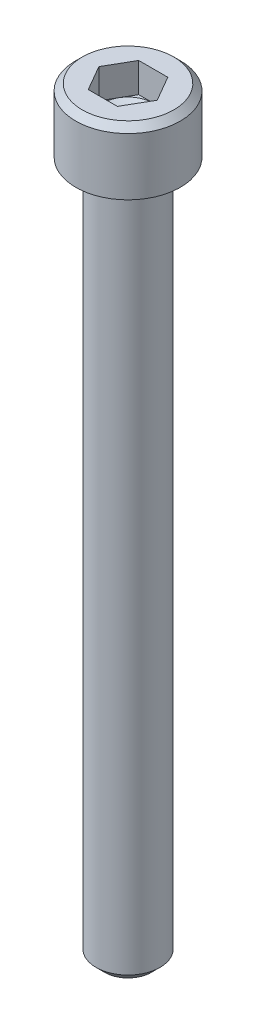
ISO-10303-21;
HEADER;
FILE_DESCRIPTION(('STEP AP214'),'2;1');
FILE_NAME('part.step','',(''),(''),'','','');
FILE_SCHEMA(('AUTOMOTIVE_DESIGN { 1 0 10303 214 1 1 1 1 }'));
ENDSEC;
DATA;
#1=APPLICATION_CONTEXT('core data for automotive mechanical design processes');
#2=APPLICATION_PROTOCOL_DEFINITION('international standard','automotive_design',2000,#1);
#3=PRODUCT_CONTEXT('',#1,'mechanical');
#4=PRODUCT('Part','Part','',(#3));
#5=PRODUCT_RELATED_PRODUCT_CATEGORY('part','',(#4));
#6=PRODUCT_DEFINITION_FORMATION('','',#4);
#7=PRODUCT_DEFINITION_CONTEXT('part definition',#1,'design');
#8=PRODUCT_DEFINITION('design','',#6,#7);
#9=PRODUCT_DEFINITION_SHAPE('','',#8);
#10=(LENGTH_UNIT() NAMED_UNIT(*) SI_UNIT(.MILLI.,.METRE.));
#11=(NAMED_UNIT(*) PLANE_ANGLE_UNIT() SI_UNIT($,.RADIAN.));
#12=(NAMED_UNIT(*) SI_UNIT($,.STERADIAN.) SOLID_ANGLE_UNIT());
#13=UNCERTAINTY_MEASURE_WITH_UNIT(LENGTH_MEASURE(1.E-05),#10,'distance_accuracy_value','');
#14=(GEOMETRIC_REPRESENTATION_CONTEXT(3) GLOBAL_UNCERTAINTY_ASSIGNED_CONTEXT((#13)) GLOBAL_UNIT_ASSIGNED_CONTEXT((#10,
#11,#12)) REPRESENTATION_CONTEXT('',''));
#15=CARTESIAN_POINT('',(0.,0.,0.));
#16=DIRECTION('',(0.,0.,1.));
#17=DIRECTION('',(1.,0.,0.));
#18=AXIS2_PLACEMENT_3D('',#15,#16,#17);
#19=CARTESIAN_POINT('',(0.,1.87960000005205,0.));
#20=DIRECTION('',(0.,1.,0.));
#21=DIRECTION('',(0.,0.,1.));
#22=AXIS2_PLACEMENT_3D('',#19,#20,#21);
#23=CONICAL_SURFACE('',#22,1.38430000009748,1.04719755120119);
#24=CARTESIAN_POINT('',(0.,1.08037402233663,5.6843418860808E-11));
#25=VERTEX_POINT('',#24);
#26=VERTEX_LOOP('',#25);
#27=FACE_BOUND('',#26,.T.);
#28=CARTESIAN_POINT('',(0.,1.87959999992078,0.));
#29=DIRECTION('',(0.,1.,0.));
#30=DIRECTION('',(0.,0.,1.));
#31=AXIS2_PLACEMENT_3D('',#28,#29,#30);
#32=CIRCLE('',#31,1.38429999987011);
#33=CARTESIAN_POINT('',(0.,1.87959999996039,-1.38429999993505));
#34=VERTEX_POINT('',#33);
#35=CARTESIAN_POINT('',(1.1988389664588,1.87959999996039,-0.692149999999999));
#36=VERTEX_POINT('',#35);
#37=EDGE_CURVE('E120',#34,#36,#32,.F.);
#38=ORIENTED_EDGE('',*,*,#37,.F.);
#39=CARTESIAN_POINT('',(0.,1.87959999998641,0.));
#40=DIRECTION('',(0.,1.,0.));
#41=DIRECTION('',(0.,0.,1.));
#42=AXIS2_PLACEMENT_3D('',#39,#40,#41);
#43=CIRCLE('',#42,1.3842999999838);
#44=CARTESIAN_POINT('',(-1.19883896645178,1.87959999999321,-0.692149999995952));
#45=VERTEX_POINT('',#44);
#46=EDGE_CURVE('E158',#45,#34,#43,.F.);
#47=ORIENTED_EDGE('',*,*,#46,.F.);
#48=CARTESIAN_POINT('',(0.,1.87959999998641,0.));
#49=DIRECTION('',(0.,1.,0.));
#50=DIRECTION('',(0.,0.,1.));
#51=AXIS2_PLACEMENT_3D('',#48,#49,#50);
#52=CIRCLE('',#51,1.3842999999838);
#53=CARTESIAN_POINT('',(-1.19883896645178,1.87960000001923,0.692149999995948));
#54=VERTEX_POINT('',#53);
#55=EDGE_CURVE('E155',#54,#45,#52,.F.);
#56=ORIENTED_EDGE('',*,*,#55,.F.);
#57=CARTESIAN_POINT('',(0.,1.87960000005205,0.));
#58=DIRECTION('',(0.,1.,0.));
#59=DIRECTION('',(0.,0.,1.));
#60=AXIS2_PLACEMENT_3D('',#57,#58,#59);
#61=CIRCLE('',#60,1.38430000009748);
#62=CARTESIAN_POINT('',(0.,1.87960000001923,1.38430000004064));
#63=VERTEX_POINT('',#62);
#64=EDGE_CURVE('E99',#63,#54,#61,.F.);
#65=ORIENTED_EDGE('',*,*,#64,.F.);
#66=CARTESIAN_POINT('',(0.,1.87959999998641,0.));
#67=DIRECTION('',(0.,1.,0.));
#68=DIRECTION('',(0.,0.,1.));
#69=AXIS2_PLACEMENT_3D('',#66,#67,#68);
#70=CIRCLE('',#69,1.3842999999838);
#71=CARTESIAN_POINT('',(1.19883896645178,1.87959999999321,0.692149999995949));
#72=VERTEX_POINT('',#71);
#73=EDGE_CURVE('E93',#72,#63,#70,.F.);
#74=ORIENTED_EDGE('',*,*,#73,.F.);
#75=CARTESIAN_POINT('',(0.,1.87959999998641,0.));
#76=DIRECTION('',(0.,1.,0.));
#77=DIRECTION('',(0.,0.,1.));
#78=AXIS2_PLACEMENT_3D('',#75,#76,#77);
#79=CIRCLE('',#78,1.3842999999838);
#80=EDGE_CURVE('E96',#36,#72,#79,.F.);
#81=ORIENTED_EDGE('',*,*,#80,.F.);
#82=EDGE_LOOP('',(#38,#47,#56,#65,#74,#81));
#83=FACE_BOUND('',#82,.T.);
#84=ADVANCED_FACE('F15',(#27,#83),#23,.F.);
#85=CARTESIAN_POINT('',(0.,1.8796,0.));
#86=DIRECTION('',(0.,1.,0.));
#87=DIRECTION('',(0.,0.,1.));
#88=AXIS2_PLACEMENT_3D('',#85,#86,#87);
#89=PLANE('',#88);
#90=DIRECTION('',(0.500000000000001,0.,-0.866025403784438));
#91=VECTOR('',#90,1.);
#92=CARTESIAN_POINT('',(0.799225977639198,1.8796,1.3843));
#93=LINE('',#92,#91);
#94=CARTESIAN_POINT('',(0.799225977639198,1.8796,1.3843));
#95=VERTEX_POINT('',#94);
#96=EDGE_CURVE('E105',#95,#72,#93,.T.);
#97=ORIENTED_EDGE('',*,*,#96,.T.);
#98=ORIENTED_EDGE('',*,*,#73,.T.);
#99=DIRECTION('',(1.,0.,0.));
#100=VECTOR('',#99,1.);
#101=CARTESIAN_POINT('',(-0.799225977639198,1.8796,1.3843));
#102=LINE('',#101,#100);
#103=EDGE_CURVE('E107',#63,#95,#102,.T.);
#104=ORIENTED_EDGE('',*,*,#103,.T.);
#105=EDGE_LOOP('',(#97,#98,#104));
#106=FACE_BOUND('',#105,.T.);
#107=ADVANCED_FACE('F106',(#106),#89,.T.);
#108=CARTESIAN_POINT('',(0.,1.8796,0.));
#109=DIRECTION('',(0.,1.,0.));
#110=DIRECTION('',(0.,0.,1.));
#111=AXIS2_PLACEMENT_3D('',#108,#109,#110);
#112=PLANE('',#111);
#113=DIRECTION('',(-0.499999999999999,0.,-0.866025403784439));
#114=VECTOR('',#113,1.);
#115=CARTESIAN_POINT('',(1.5984519552784,1.8796,0.));
#116=LINE('',#115,#114);
#117=CARTESIAN_POINT('',(1.5984519552784,1.8796,0.));
#118=VERTEX_POINT('',#117);
#119=EDGE_CURVE('E118',#118,#36,#116,.T.);
#120=ORIENTED_EDGE('',*,*,#119,.T.);
#121=ORIENTED_EDGE('',*,*,#80,.T.);
#122=DIRECTION('',(0.500000000000001,0.,-0.866025403784438));
#123=VECTOR('',#122,1.);
#124=CARTESIAN_POINT('',(0.799225977639198,1.8796,1.3843));
#125=LINE('',#124,#123);
#126=EDGE_CURVE('E112',#72,#118,#125,.T.);
#127=ORIENTED_EDGE('',*,*,#126,.T.);
#128=EDGE_LOOP('',(#120,#121,#127));
#129=FACE_BOUND('',#128,.T.);
#130=ADVANCED_FACE('F115',(#129),#112,.T.);
#131=CARTESIAN_POINT('',(0.,1.8796,0.));
#132=DIRECTION('',(0.,1.,0.));
#133=DIRECTION('',(0.,0.,1.));
#134=AXIS2_PLACEMENT_3D('',#131,#132,#133);
#135=PLANE('',#134);
#136=DIRECTION('',(-1.,0.,0.));
#137=VECTOR('',#136,1.);
#138=CARTESIAN_POINT('',(0.799225977639201,1.8796,-1.3843));
#139=LINE('',#138,#137);
#140=CARTESIAN_POINT('',(0.799225977639201,1.8796,-1.3843));
#141=VERTEX_POINT('',#140);
#142=EDGE_CURVE('E168',#141,#34,#139,.T.);
#143=ORIENTED_EDGE('',*,*,#142,.T.);
#144=ORIENTED_EDGE('',*,*,#37,.T.);
#145=DIRECTION('',(-0.499999999999999,0.,-0.866025403784439));
#146=VECTOR('',#145,1.);
#147=CARTESIAN_POINT('',(1.5984519552784,1.8796,0.));
#148=LINE('',#147,#146);
#149=EDGE_CURVE('E165',#36,#141,#148,.T.);
#150=ORIENTED_EDGE('',*,*,#149,.T.);
#151=EDGE_LOOP('',(#143,#144,#150));
#152=FACE_BOUND('',#151,.T.);
#153=ADVANCED_FACE('F164',(#152),#135,.T.);
#154=CARTESIAN_POINT('',(0.,1.8796,0.));
#155=DIRECTION('',(0.,1.,0.));
#156=DIRECTION('',(0.,0.,1.));
#157=AXIS2_PLACEMENT_3D('',#154,#155,#156);
#158=PLANE('',#157);
#159=DIRECTION('',(-0.5,0.,0.866025403784438));
#160=VECTOR('',#159,1.);
#161=CARTESIAN_POINT('',(-0.799225977639195,1.8796,-1.3843));
#162=LINE('',#161,#160);
#163=CARTESIAN_POINT('',(-0.799225977639196,1.8796,-1.3843));
#164=VERTEX_POINT('',#163);
#165=EDGE_CURVE('E183',#164,#45,#162,.T.);
#166=ORIENTED_EDGE('',*,*,#165,.T.);
#167=ORIENTED_EDGE('',*,*,#46,.T.);
#168=DIRECTION('',(-1.,0.,0.));
#169=VECTOR('',#168,1.);
#170=CARTESIAN_POINT('',(0.799225977639201,1.8796,-1.3843));
#171=LINE('',#170,#169);
#172=EDGE_CURVE('E184',#34,#164,#171,.T.);
#173=ORIENTED_EDGE('',*,*,#172,.T.);
#174=EDGE_LOOP('',(#166,#167,#173));
#175=FACE_BOUND('',#174,.T.);
#176=ADVANCED_FACE('F328',(#175),#158,.T.);
#177=CARTESIAN_POINT('',(0.,1.8796,0.));
#178=DIRECTION('',(0.,1.,0.));
#179=DIRECTION('',(0.,0.,1.));
#180=AXIS2_PLACEMENT_3D('',#177,#178,#179);
#181=PLANE('',#180);
#182=DIRECTION('',(0.5,0.,0.866025403784439));
#183=VECTOR('',#182,1.);
#184=CARTESIAN_POINT('',(-1.5984519552784,1.8796,0.));
#185=LINE('',#184,#183);
#186=CARTESIAN_POINT('',(-1.5984519552784,1.8796,0.));
#187=VERTEX_POINT('',#186);
#188=EDGE_CURVE('E196',#187,#54,#185,.T.);
#189=ORIENTED_EDGE('',*,*,#188,.T.);
#190=ORIENTED_EDGE('',*,*,#55,.T.);
#191=DIRECTION('',(-0.5,0.,0.866025403784438));
#192=VECTOR('',#191,1.);
#193=CARTESIAN_POINT('',(-0.799225977639195,1.8796,-1.3843));
#194=LINE('',#193,#192);
#195=EDGE_CURVE('E197',#45,#187,#194,.T.);
#196=ORIENTED_EDGE('',*,*,#195,.T.);
#197=EDGE_LOOP('',(#189,#190,#196));
#198=FACE_BOUND('',#197,.T.);
#199=ADVANCED_FACE('F324',(#198),#181,.T.);
#200=CARTESIAN_POINT('',(0.,1.8796,0.));
#201=DIRECTION('',(0.,1.,0.));
#202=DIRECTION('',(0.,0.,1.));
#203=AXIS2_PLACEMENT_3D('',#200,#201,#202);
#204=PLANE('',#203);
#205=DIRECTION('',(1.,0.,0.));
#206=VECTOR('',#205,1.);
#207=CARTESIAN_POINT('',(-0.799225977639198,1.8796,1.3843));
#208=LINE('',#207,#206);
#209=CARTESIAN_POINT('',(-0.799225977639198,1.8796,1.3843));
#210=VERTEX_POINT('',#209);
#211=EDGE_CURVE('E139',#210,#63,#208,.T.);
#212=ORIENTED_EDGE('',*,*,#211,.T.);
#213=ORIENTED_EDGE('',*,*,#64,.T.);
#214=DIRECTION('',(0.5,0.,0.866025403784439));
#215=VECTOR('',#214,1.);
#216=CARTESIAN_POINT('',(-1.5984519552784,1.8796,0.));
#217=LINE('',#216,#215);
#218=EDGE_CURVE('E215',#54,#210,#217,.T.);
#219=ORIENTED_EDGE('',*,*,#218,.T.);
#220=EDGE_LOOP('',(#212,#213,#219));
#221=FACE_BOUND('',#220,.T.);
#222=ADVANCED_FACE('F320',(#221),#204,.T.);
#223=CARTESIAN_POINT('',(-0.799225977639198,3.5052,1.3843));
#224=DIRECTION('',(0.,0.,1.));
#225=DIRECTION('',(1.,0.,0.));
#226=AXIS2_PLACEMENT_3D('',#223,#224,#225);
#227=PLANE('',#226);
#228=DIRECTION('',(1.,0.,0.));
#229=VECTOR('',#228,1.);
#230=CARTESIAN_POINT('',(0.,3.5052,1.3843));
#231=LINE('',#230,#229);
#232=CARTESIAN_POINT('',(-0.799225977639198,3.5052,1.3843));
#233=VERTEX_POINT('',#232);
#234=CARTESIAN_POINT('',(0.799225977639198,3.5052,1.3843));
#235=VERTEX_POINT('',#234);
#236=EDGE_CURVE('E210',#233,#235,#231,.T.);
#237=ORIENTED_EDGE('',*,*,#236,.T.);
#238=DIRECTION('',(0.,1.,0.));
#239=VECTOR('',#238,1.);
#240=CARTESIAN_POINT('',(0.799225977639198,3.5052,1.3843));
#241=LINE('',#240,#239);
#242=EDGE_CURVE('E125',#235,#95,#241,.F.);
#243=ORIENTED_EDGE('',*,*,#242,.T.);
#244=ORIENTED_EDGE('',*,*,#103,.F.);
#245=ORIENTED_EDGE('',*,*,#211,.F.);
#246=DIRECTION('',(0.,1.,0.));
#247=VECTOR('',#246,1.);
#248=CARTESIAN_POINT('',(-0.799225977639198,3.5052,1.3843));
#249=LINE('',#248,#247);
#250=EDGE_CURVE('E211',#210,#233,#249,.T.);
#251=ORIENTED_EDGE('',*,*,#250,.T.);
#252=EDGE_LOOP('',(#237,#243,#244,#245,#251));
#253=FACE_BOUND('',#252,.T.);
#254=ADVANCED_FACE('F317',(#253),#227,.F.);
#255=CARTESIAN_POINT('',(0.799225977639198,3.5052,1.3843));
#256=DIRECTION('',(0.866025403784438,0.,0.500000000000001));
#257=DIRECTION('',(0.500000000000001,0.,-0.866025403784438));
#258=AXIS2_PLACEMENT_3D('',#255,#256,#257);
#259=PLANE('',#258);
#260=DIRECTION('',(0.500000000000001,0.,-0.866025403784438));
#261=VECTOR('',#260,1.);
#262=CARTESIAN_POINT('',(0.799225977639198,3.5052,1.3843));
#263=LINE('',#262,#261);
#264=CARTESIAN_POINT('',(1.5984519552784,3.5052,0.));
#265=VERTEX_POINT('',#264);
#266=EDGE_CURVE('E227',#235,#265,#263,.T.);
#267=ORIENTED_EDGE('',*,*,#266,.T.);
#268=DIRECTION('',(0.,1.,0.));
#269=VECTOR('',#268,1.);
#270=CARTESIAN_POINT('',(1.5984519552784,3.5052,0.));
#271=LINE('',#270,#269);
#272=EDGE_CURVE('E124',#265,#118,#271,.F.);
#273=ORIENTED_EDGE('',*,*,#272,.T.);
#274=ORIENTED_EDGE('',*,*,#126,.F.);
#275=ORIENTED_EDGE('',*,*,#96,.F.);
#276=ORIENTED_EDGE('',*,*,#242,.F.);
#277=EDGE_LOOP('',(#267,#273,#274,#275,#276));
#278=FACE_BOUND('',#277,.T.);
#279=ADVANCED_FACE('F122',(#278),#259,.F.);
#280=CARTESIAN_POINT('',(1.5984519552784,3.5052,0.));
#281=DIRECTION('',(0.866025403784439,0.,-0.499999999999999));
#282=DIRECTION('',(-0.499999999999999,0.,-0.866025403784439));
#283=AXIS2_PLACEMENT_3D('',#280,#281,#282);
#284=PLANE('',#283);
#285=DIRECTION('',(-0.499999999999999,0.,-0.866025403784439));
#286=VECTOR('',#285,1.);
#287=CARTESIAN_POINT('',(1.5984519552784,3.5052,0.));
#288=LINE('',#287,#286);
#289=CARTESIAN_POINT('',(0.799225977639201,3.5052,-1.3843));
#290=VERTEX_POINT('',#289);
#291=EDGE_CURVE('E229',#265,#290,#288,.T.);
#292=ORIENTED_EDGE('',*,*,#291,.T.);
#293=DIRECTION('',(0.,1.,0.));
#294=VECTOR('',#293,1.);
#295=CARTESIAN_POINT('',(0.799225977639201,3.5052,-1.3843));
#296=LINE('',#295,#294);
#297=EDGE_CURVE('E172',#290,#141,#296,.F.);
#298=ORIENTED_EDGE('',*,*,#297,.T.);
#299=ORIENTED_EDGE('',*,*,#149,.F.);
#300=ORIENTED_EDGE('',*,*,#119,.F.);
#301=ORIENTED_EDGE('',*,*,#272,.F.);
#302=EDGE_LOOP('',(#292,#298,#299,#300,#301));
#303=FACE_BOUND('',#302,.T.);
#304=ADVANCED_FACE('F170',(#303),#284,.F.);
#305=CARTESIAN_POINT('',(0.799225977639201,3.5052,-1.3843));
#306=DIRECTION('',(0.,0.,-1.));
#307=DIRECTION('',(-1.,0.,0.));
#308=AXIS2_PLACEMENT_3D('',#305,#306,#307);
#309=PLANE('',#308);
#310=DIRECTION('',(1.,0.,0.));
#311=VECTOR('',#310,1.);
#312=CARTESIAN_POINT('',(0.,3.5052,-1.3843));
#313=LINE('',#312,#311);
#314=CARTESIAN_POINT('',(-0.799225977639196,3.5052,-1.3843));
#315=VERTEX_POINT('',#314);
#316=EDGE_CURVE('E231',#290,#315,#313,.F.);
#317=ORIENTED_EDGE('',*,*,#316,.T.);
#318=DIRECTION('',(0.,1.,0.));
#319=VECTOR('',#318,1.);
#320=CARTESIAN_POINT('',(-0.799225977639195,3.5052,-1.3843));
#321=LINE('',#320,#319);
#322=EDGE_CURVE('E193',#315,#164,#321,.F.);
#323=ORIENTED_EDGE('',*,*,#322,.T.);
#324=ORIENTED_EDGE('',*,*,#172,.F.);
#325=ORIENTED_EDGE('',*,*,#142,.F.);
#326=ORIENTED_EDGE('',*,*,#297,.F.);
#327=EDGE_LOOP('',(#317,#323,#324,#325,#326));
#328=FACE_BOUND('',#327,.T.);
#329=ADVANCED_FACE('F308',(#328),#309,.F.);
#330=CARTESIAN_POINT('',(-0.799225977639195,3.5052,-1.3843));
#331=DIRECTION('',(-0.866025403784438,0.,-0.5));
#332=DIRECTION('',(-0.5,0.,0.866025403784438));
#333=AXIS2_PLACEMENT_3D('',#330,#331,#332);
#334=PLANE('',#333);
#335=DIRECTION('',(-0.500000000000002,0.,0.866025403784438));
#336=VECTOR('',#335,1.);
#337=CARTESIAN_POINT('',(-0.799225977639195,3.5052,-1.3843));
#338=LINE('',#337,#336);
#339=CARTESIAN_POINT('',(-1.5984519552784,3.5052,0.));
#340=VERTEX_POINT('',#339);
#341=EDGE_CURVE('E233',#315,#340,#338,.T.);
#342=ORIENTED_EDGE('',*,*,#341,.T.);
#343=DIRECTION('',(0.,1.,0.));
#344=VECTOR('',#343,1.);
#345=CARTESIAN_POINT('',(-1.5984519552784,3.5052,0.));
#346=LINE('',#345,#344);
#347=EDGE_CURVE('E207',#340,#187,#346,.F.);
#348=ORIENTED_EDGE('',*,*,#347,.T.);
#349=ORIENTED_EDGE('',*,*,#195,.F.);
#350=ORIENTED_EDGE('',*,*,#165,.F.);
#351=ORIENTED_EDGE('',*,*,#322,.F.);
#352=EDGE_LOOP('',(#342,#348,#349,#350,#351));
#353=FACE_BOUND('',#352,.T.);
#354=ADVANCED_FACE('F304',(#353),#334,.F.);
#355=CARTESIAN_POINT('',(-1.5984519552784,3.5052,0.));
#356=DIRECTION('',(-0.866025403784439,0.,0.5));
#357=DIRECTION('',(0.5,0.,0.866025403784439));
#358=AXIS2_PLACEMENT_3D('',#355,#356,#357);
#359=PLANE('',#358);
#360=DIRECTION('',(0.5,0.,0.866025403784439));
#361=VECTOR('',#360,1.);
#362=CARTESIAN_POINT('',(-1.5984519552784,3.5052,0.));
#363=LINE('',#362,#361);
#364=EDGE_CURVE('E153',#340,#233,#363,.T.);
#365=ORIENTED_EDGE('',*,*,#364,.T.);
#366=ORIENTED_EDGE('',*,*,#250,.F.);
#367=ORIENTED_EDGE('',*,*,#218,.F.);
#368=ORIENTED_EDGE('',*,*,#188,.F.);
#369=ORIENTED_EDGE('',*,*,#347,.F.);
#370=EDGE_LOOP('',(#365,#366,#367,#368,#369));
#371=FACE_BOUND('',#370,.T.);
#372=ADVANCED_FACE('F300',(#371),#359,.F.);
#373=CARTESIAN_POINT('',(0.,3.5052,0.));
#374=DIRECTION('',(0.,-1.,0.));
#375=DIRECTION('',(0.,0.,-1.));
#376=AXIS2_PLACEMENT_3D('',#373,#374,#375);
#377=PLANE('',#376);
#378=ORIENTED_EDGE('',*,*,#341,.F.);
#379=ORIENTED_EDGE('',*,*,#316,.F.);
#380=ORIENTED_EDGE('',*,*,#291,.F.);
#381=ORIENTED_EDGE('',*,*,#266,.F.);
#382=ORIENTED_EDGE('',*,*,#236,.F.);
#383=ORIENTED_EDGE('',*,*,#364,.F.);
#384=EDGE_LOOP('',(#378,#379,#380,#381,#382,#383));
#385=FACE_BOUND('',#384,.T.);
#386=CARTESIAN_POINT('',(0.,3.50520000102961,0.));
#387=DIRECTION('',(0.,-1.,0.));
#388=DIRECTION('',(1.,0.,0.));
#389=AXIS2_PLACEMENT_3D('',#386,#387,#388);
#390=CIRCLE('',#389,2.51459999901726);
#391=CARTESIAN_POINT('',(2.51459999901726,3.50520000102961,0.));
#392=VERTEX_POINT('',#391);
#393=EDGE_CURVE('E150',#392,#392,#390,.T.);
#394=ORIENTED_EDGE('',*,*,#393,.F.);
#395=EDGE_LOOP('',(#394));
#396=FACE_BOUND('',#395,.T.);
#397=ADVANCED_FACE('F296',(#385,#396),#377,.F.);
#398=CARTESIAN_POINT('',(0.,3.14960000184783,0.));
#399=DIRECTION('',(0.,-1.,0.));
#400=DIRECTION('',(1.,0.,0.));
#401=AXIS2_PLACEMENT_3D('',#398,#399,#400);
#402=CONICAL_SURFACE('',#401,2.8701999981422,0.785398163317522);
#403=CARTESIAN_POINT('',(0.,3.1496,0.));
#404=DIRECTION('',(0.,-1.,0.));
#405=DIRECTION('',(0.,0.,-1.));
#406=AXIS2_PLACEMENT_3D('',#403,#404,#405);
#407=CIRCLE('',#406,2.8702);
#408=CARTESIAN_POINT('',(0.,3.1496,-2.8702));
#409=VERTEX_POINT('',#408);
#410=EDGE_CURVE('E149',#409,#409,#407,.T.);
#411=ORIENTED_EDGE('',*,*,#410,.F.);
#412=EDGE_LOOP('',(#411));
#413=FACE_BOUND('',#412,.T.);
#414=ORIENTED_EDGE('',*,*,#393,.T.);
#415=EDGE_LOOP('',(#414));
#416=FACE_BOUND('',#415,.T.);
#417=ADVANCED_FACE('F292',(#413,#416),#402,.T.);
#418=CARTESIAN_POINT('',(0.,5.58546,0.));
#419=DIRECTION('',(0.,-1.,0.));
#420=DIRECTION('',(0.,0.,-1.));
#421=AXIS2_PLACEMENT_3D('',#418,#419,#420);
#422=CYLINDRICAL_SURFACE('',#421,2.8702);
#423=CARTESIAN_POINT('',(0.,0.,0.));
#424=DIRECTION('',(0.,-1.,0.));
#425=DIRECTION('',(0.,0.,-1.));
#426=AXIS2_PLACEMENT_3D('',#423,#424,#425);
#427=CIRCLE('',#426,2.8702);
#428=CARTESIAN_POINT('',(0.,0.,-2.8702));
#429=VERTEX_POINT('',#428);
#430=EDGE_CURVE('E146',#429,#429,#427,.T.);
#431=ORIENTED_EDGE('',*,*,#430,.F.);
#432=EDGE_LOOP('',(#431));
#433=FACE_BOUND('',#432,.T.);
#434=ORIENTED_EDGE('',*,*,#410,.T.);
#435=EDGE_LOOP('',(#434));
#436=FACE_BOUND('',#435,.T.);
#437=ADVANCED_FACE('F288',(#433,#436),#422,.T.);
#438=CARTESIAN_POINT('',(0.,-38.1,0.));
#439=DIRECTION('',(0.,-1.,0.));
#440=DIRECTION('',(0.,0.,-1.));
#441=AXIS2_PLACEMENT_3D('',#438,#439,#440);
#442=PLANE('',#441);
#443=CARTESIAN_POINT('',(0.,-38.100000001009,0.));
#444=DIRECTION('',(0.,1.,0.));
#445=DIRECTION('',(0.,0.,1.));
#446=AXIS2_PLACEMENT_3D('',#443,#444,#445);
#447=CIRCLE('',#446,1.2801599989416);
#448=CARTESIAN_POINT('',(0.,-38.100000001009,1.2801599989416));
#449=VERTEX_POINT('',#448);
#450=EDGE_CURVE('E142',#449,#449,#447,.T.);
#451=ORIENTED_EDGE('',*,*,#450,.F.);
#452=EDGE_LOOP('',(#451));
#453=FACE_BOUND('',#452,.T.);
#454=ADVANCED_FACE('F277',(#453),#442,.T.);
#455=CARTESIAN_POINT('',(0.,0.,0.));
#456=DIRECTION('',(0.,-1.,0.));
#457=DIRECTION('',(0.,0.,-1.));
#458=AXIS2_PLACEMENT_3D('',#455,#456,#457);
#459=PLANE('',#458);
#460=CARTESIAN_POINT('',(-2.0066,0.,0.));
#461=CARTESIAN_POINT('',(-2.00659107125037,-2.17372417731573E-10,-0.00466417912295062));
#462=CARTESIAN_POINT('',(-2.00656818150294,-5.08689040938276E-10,-0.00932835809195502));
#463=CARTESIAN_POINT('',(-2.00646194575931,-1.4436833953423E-09,-0.0224980446793489));
#464=CARTESIAN_POINT('',(-2.0063443334026,-2.17995457543655E-09,-0.0310032934790011));
#465=CARTESIAN_POINT('',(-2.00592436920175,-3.80214652783731E-09,-0.0518524949147936));
#466=CARTESIAN_POINT('',(-2.00556257246323,-4.60547425629851E-09,-0.0641952914634144));
#467=CARTESIAN_POINT('',(-2.00446549349536,-6.27154855269247E-09,-0.092710935031785));
#468=CARTESIAN_POINT('',(-2.00364903422839,-7.07502708096622E-09,-0.108880695035327));
#469=CARTESIAN_POINT('',(-2.00138611323741,-8.57357001299133E-09,-0.14502987593377));
#470=CARTESIAN_POINT('',(-1.99983613298495,-9.19767329246378E-09,-0.165002871846353));
#471=CARTESIAN_POINT('',(-1.99578557902614,-1.02497240668701E-08,-0.208718776686783));
#472=CARTESIAN_POINT('',(-1.99315971287711,-1.06171043842025E-08,-0.232450133426172));
#473=CARTESIAN_POINT('',(-1.98657325334525,-1.10888584521111E-08,-0.283614389250321));
#474=CARTESIAN_POINT('',(-1.98246588177666,-1.11414025321392E-08,-0.311028480883419));
#475=CARTESIAN_POINT('',(-1.97247230497577,-1.09639964244428E-08,-0.369449365350258));
#476=CARTESIAN_POINT('',(-1.96641845944816,-1.06938848349515E-08,-0.400427505535502));
#477=CARTESIAN_POINT('',(-1.95203115968284,-9.89426990824788E-09,-0.465817665255936));
#478=CARTESIAN_POINT('',(-1.94350992555125,-9.33719573978899E-09,-0.500188700943714));
#479=CARTESIAN_POINT('',(-1.92899162757292,-8.37273550181542E-09,-0.552756345468155));
#480=CARTESIAN_POINT('',(-1.92363258523647,-8.01409993985775E-09,-0.571131762823284));
#481=CARTESIAN_POINT('',(-1.91210887662568,-7.26966673569718E-09,-0.608640426007387));
#482=CARTESIAN_POINT('',(-1.9059172786478,-6.88340914758666E-09,-0.627765430841449));
#483=CARTESIAN_POINT('',(-1.8926531178931,-6.03900676906752E-09,-0.666730005736731));
#484=CARTESIAN_POINT('',(-1.88555259715065,-5.57830895306115E-09,-0.686560055005602));
#485=CARTESIAN_POINT('',(-1.87039210837565,-4.84629397936236E-09,-0.726885562160989));
#486=CARTESIAN_POINT('',(-1.86230315323351,-4.58457116845413E-09,-0.747370125746264));
#487=CARTESIAN_POINT('',(-1.84474413619814,-3.27483388922217E-09,-0.789789835591336));
#488=CARTESIAN_POINT('',(-1.83521512406348,-2.1619913999618E-09,-0.811700597128929));
#489=CARTESIAN_POINT('',(-1.81538947694117,-2.44289198071639E-10,-0.855171751419322));
#490=CARTESIAN_POINT('',(-1.80509284735109,5.60572679911494E-10,-0.876732146634461));
#491=CARTESIAN_POINT('',(-1.78374308810927,-2.22615197483665E-09,-0.919475260597962));
#492=CARTESIAN_POINT('',(-1.77268995419049,-5.8177633075741E-09,-0.940657977215199));
#493=CARTESIAN_POINT('',(-1.74984266803556,-2.68140368498055E-08,-0.982620386013393));
#494=CARTESIAN_POINT('',(-1.73804850223372,-4.42189520000659E-08,-1.00340007080714));
#495=CARTESIAN_POINT('',(-1.71372822644424,-9.30065573260291E-08,-1.04452785357651));
#496=CARTESIAN_POINT('',(-1.70120209379136,-1.24389680534056E-07,-1.06487593816109));
#497=CARTESIAN_POINT('',(-1.68189071005398,-2.1706586973768E-07,-1.09506338268652));
#498=CARTESIAN_POINT('',(-1.67536631309325,-2.55560335864502E-07,-1.10507042929671));
#499=CARTESIAN_POINT('',(-1.66551597391481,-2.92454713630481E-07,-1.11985795817529));
#500=CARTESIAN_POINT('',(-1.66226478689897,-3.01292324988849E-07,-1.12468822374474));
#501=CARTESIAN_POINT('',(-1.64789832863821,-3.22726996693511E-07,-1.14581372489602));
#502=CARTESIAN_POINT('',(-1.636541968214,-2.93913248166431E-07,-1.16194507058645));
#503=CARTESIAN_POINT('',(-1.60155110269778,-2.03523157943073E-07,-1.2101087748921));
#504=CARTESIAN_POINT('',(-1.57718421705209,-1.3844986365244E-07,-1.24161434230092));
#505=CARTESIAN_POINT('',(-1.53585304662112,-5.99763167432239E-08,-1.29187971241513));
#506=CARTESIAN_POINT('',(-1.5194347452822,-3.63841312156832E-08,-1.31109275642661));
#507=CARTESIAN_POINT('',(-1.48592851212118,-7.02378354748848E-09,-1.34884174848752));
#508=CARTESIAN_POINT('',(-1.46884236731981,-1.21096556081093E-09,-1.36737927717382));
#509=CARTESIAN_POINT('',(-1.44069878884883,4.28184349258728E-10,-1.39679865368243));
#510=CARTESIAN_POINT('',(-1.42985084841684,-7.63875555731625E-10,-1.4078821137349));
#511=CARTESIAN_POINT('',(-1.40197239658634,-2.42473650937832E-09,-1.43573521171882));
#512=CARTESIAN_POINT('',(-1.38477276164506,-2.15312162000432E-09,-1.45233640300063));
#513=CARTESIAN_POINT('',(-1.34979601921316,-8.97682662995708E-10,-1.48491758027379));
#514=CARTESIAN_POINT('',(-1.3320189238899,8.61264076592923E-11,-1.50089757933839));
#515=CARTESIAN_POINT('',(-1.29591287909011,-1.44720178847023E-10,-1.53222137771586));
#516=CARTESIAN_POINT('',(-1.27758393212768,-1.35936582188619E-09,-1.54756517992635));
#517=CARTESIAN_POINT('',(-1.24039671100612,-1.6979805779475E-08,-1.57759775232392));
#518=CARTESIAN_POINT('',(-1.22153843052638,-3.13857576722766E-08,-1.59228651468395));
#519=CARTESIAN_POINT('',(-1.18331193082143,-7.624315410548E-08,-1.62098647090216));
#520=CARTESIAN_POINT('',(-1.16394369710635,-1.06695055045551E-07,-1.63499764547513));
#521=CARTESIAN_POINT('',(-1.13453797522568,-2.03842876251541E-07,-1.65550687214814));
#522=CARTESIAN_POINT('',(-1.12467681878487,-2.44806163489079E-07,-1.66225892096569));
#523=CARTESIAN_POINT('',(-1.10989529467611,-2.86529269660004E-07,-1.67216698897289));
#524=CARTESIAN_POINT('',(-1.10502493633019,-2.97136751831384E-07,-1.67539760791403));
#525=CARTESIAN_POINT('',(-1.08364289719895,-3.25408009909288E-07,-1.6894328929251));
#526=CARTESIAN_POINT('',(-1.06697030770968,-2.99939732945329E-07,-1.69999282000085));
#527=CARTESIAN_POINT('',(-1.02417312953762,-2.31742604165867E-07,-1.72621628700712));
#528=CARTESIAN_POINT('',(-0.997835689675166,-1.871549882317E-07,-1.74153479290111));
#529=CARTESIAN_POINT('',(-0.963027566640394,-1.31302509755612E-07,-1.76072296713663));
#530=CARTESIAN_POINT('',(-0.954860461856639,-1.18414246139726E-07,-1.76515070690561));
#531=CARTESIAN_POINT('',(-0.92340397757229,-7.28836948513213E-08,-1.7819230737943));
#532=CARTESIAN_POINT('',(-0.899898978307661,-4.74521641235008E-08,-1.79386732331947));
#533=CARTESIAN_POINT('',(-0.853333703129807,-1.36873716377939E-08,-1.81638903815323));
#534=CARTESIAN_POINT('',(-0.830290114483393,-4.74512600808109E-09,-1.82700107108451));
#535=CARTESIAN_POINT('',(-0.794060750572248,8.2392068628733E-11,-1.8428690029017));
#536=CARTESIAN_POINT('',(-0.781005352004837,-1.52204158506432E-11,-1.84842459737041));
#537=CARTESIAN_POINT('',(-0.745808147504192,-4.03169523795394E-10,-1.86297914626568));
#538=CARTESIAN_POINT('',(-0.723563822759986,-7.7969143327115E-10,-1.87173199117378));
#539=CARTESIAN_POINT('',(-0.678779669737502,-5.13978327351335E-10,-1.8884430019663));
#540=CARTESIAN_POINT('',(-0.6562398485848,1.28232167059106E-10,-1.89640118697336));
#541=CARTESIAN_POINT('',(-0.610894117492838,-3.16438390033108E-10,-1.91151907770501));
#542=CARTESIAN_POINT('',(-0.588088209369373,-1.40330764902007E-09,-1.91867878887493));
#543=CARTESIAN_POINT('',(-0.542238263813657,-1.58064614105453E-08,-1.93219093924182));
#544=CARTESIAN_POINT('',(-0.51919422390049,-2.91228734507229E-08,-1.93854337001915));
#545=CARTESIAN_POINT('',(-0.472894487820451,-7.1007504254823E-08,-1.95042749547901));
#546=CARTESIAN_POINT('',(-0.449638785813452,-9.95761451160483E-08,-1.95595916744206));
#547=CARTESIAN_POINT('',(-0.41462312605267,-1.93428062095696E-07,-1.96365312389372));
#548=CARTESIAN_POINT('',(-0.402928807919902,-2.33214157375791E-07,-1.96611726020354));
#549=CARTESIAN_POINT('',(-0.385566953614097,-2.73203637890335E-07,-1.96959667614286));
#550=CARTESIAN_POINT('',(-0.379917254896827,-2.83234803870748E-07,-1.97070094217815));
#551=CARTESIAN_POINT('',(-0.354936385380374,-3.10356489097724E-07,-1.97546071547243));
#552=CARTESIAN_POINT('',(-0.335550434222069,-2.85882898956264E-07,-1.97882985053516));
#553=CARTESIAN_POINT('',(-0.285940030213482,-2.20737483580227E-07,-1.98669684722702));
#554=CARTESIAN_POINT('',(-0.255649911325044,-1.78591896133503E-07,-1.99078867419358));
#555=CARTESIAN_POINT('',(-0.216004382919225,-1.25570615676064E-07,-1.99521616496931));
#556=CARTESIAN_POINT('',(-0.206716322215919,-1.1330176885027E-07,-1.99618717632358));
#557=CARTESIAN_POINT('',(-0.171573768567341,-7.06265717566099E-08,-1.99961340903278));
#558=CARTESIAN_POINT('',(-0.145674926833488,-4.68322396916685E-08,-2.00163210575391));
#559=CARTESIAN_POINT('',(-0.0944902196310278,-1.46598759354592E-08,-2.00462571553725));
#560=CARTESIAN_POINT('',(-0.0692058376111983,-5.89878980874125E-09,-2.00562629080244));
#561=CARTESIAN_POINT('',(-0.0292772017960967,-3.78213810592856E-10,-2.00645995855446));
#562=CARTESIAN_POINT('',(-0.0146387534995744,-1.17197388306547E-10,-2.00660733621226));
#563=CARTESIAN_POINT('',(0.023892474335974,1.91282442321442E-10,-2.00658802628992));
#564=CARTESIAN_POINT('',(0.0477857679469371,-5.50829993931221E-13,-2.00616391430296));
#565=CARTESIAN_POINT('',(0.095541426724868,-5.99569503994549E-11,-2.00446803364737));
#566=CARTESIAN_POINT('',(0.119403792473587,7.24640110749992E-11,-2.00319628116162));
#567=CARTESIAN_POINT('',(0.167068858979938,-2.20299590405446E-09,-1.99981272385316));
#568=CARTESIAN_POINT('',(0.190871559940359,-4.61086813491821E-09,-1.99770092188953));
#569=CARTESIAN_POINT('',(0.238388021459979,-2.15714959517381E-08,-1.99263986255505));
#570=CARTESIAN_POINT('',(0.262101780923085,-3.6124400719299E-08,-1.98969059489762));
#571=CARTESIAN_POINT('',(0.30941068189519,-7.89166188985837E-08,-1.98295234457647));
#572=CARTESIAN_POINT('',(0.333005820068019,-1.07156315093394E-07,-1.9791633384291));
#573=CARTESIAN_POINT('',(0.368289455882111,-1.97210663342158E-07,-1.97287118068365));
#574=CARTESIAN_POINT('',(0.380032896476445,-2.35180067174636E-07,-1.97067226613574));
#575=CARTESIAN_POINT('',(0.397339161000045,-2.71649476808518E-07,-1.96725428557992));
#576=CARTESIAN_POINT('',(0.402919663242346,-2.80406132293027E-07,-1.9661247907913));
#577=CARTESIAN_POINT('',(0.427720297518202,-3.03054260824843E-07,-1.96098433242395));
#578=CARTESIAN_POINT('',(0.446881627742742,-2.77022300213355E-07,-1.95668948406659));
#579=CARTESIAN_POINT('',(0.504878275768167,-1.94766405212411E-07,-1.94278505253125));
#580=CARTESIAN_POINT('',(0.543504340404772,-1.35234091357691E-07,-1.93228365275804));
#581=CARTESIAN_POINT('',(0.605937797584589,-6.19245922871136E-08,-1.91328135979532));
#582=CARTESIAN_POINT('',(0.629958682531899,-3.93703856749126E-08,-1.90547015807005));
#583=CARTESIAN_POINT('',(0.677629186807667,-1.01358280444866E-08,-1.88897161416029));
#584=CARTESIAN_POINT('',(0.701279611917189,-3.41417359700502E-09,-1.88028661344407));
#585=CARTESIAN_POINT('',(0.739202768090774,2.58529787677104E-10,-1.86555630154349));
#586=CARTESIAN_POINT('',(0.753581506210322,-2.56690877276177E-11,-1.85978150375803));
#587=CARTESIAN_POINT('',(0.789964706495839,-3.66408093049474E-10,-1.84469394422711));
#588=CARTESIAN_POINT('',(0.81187813170943,-2.16054726869098E-10,-1.8351601102195));
#589=CARTESIAN_POINT('',(0.855351990580033,3.99842675979718E-11,-1.81532076316739));
#590=CARTESIAN_POINT('',(0.876912430015962,1.45670627856011E-10,-1.80501526277167));
#591=CARTESIAN_POINT('',(0.919656570425399,-2.68664088133534E-09,-1.78365049043271));
#592=CARTESIAN_POINT('',(0.940840271918547,-5.62463455227699E-09,-1.77259121952926));
#593=CARTESIAN_POINT('',(0.982804839082464,-2.43595396045539E-08,-1.74973254162744));
#594=CARTESIAN_POINT('',(1.00358569925935,-4.01566262299392E-08,-1.73793312454437));
#595=CARTESIAN_POINT('',(1.04471630865199,-8.58575277259819E-08,-1.71360351955151));
#596=CARTESIAN_POINT('',(1.0650660455061,-1.15761746521153E-07,-1.70107331072623));
#597=CARTESIAN_POINT('',(1.09525663897101,-2.08428146173775E-07,-1.68175692892747));
#598=CARTESIAN_POINT('',(1.10526484492458,-2.47287481751222E-07,-1.67523105340291));
#599=CARTESIAN_POINT('',(1.12002480504975,-2.84981693725614E-07,-1.66539770224488));
#600=CARTESIAN_POINT('',(1.12482661056459,-2.94122688753924E-07,-1.66216537529849));
#601=CARTESIAN_POINT('',(1.14590069109473,-3.17090359100481E-07,-1.64783323046937));
#602=CARTESIAN_POINT('',(1.16200915339673,-2.89393685127294E-07,-1.63649245242608));
#603=CARTESIAN_POINT('',(1.21018413460286,-2.02005047779883E-07,-1.60149350559882));
#604=CARTESIAN_POINT('',(1.24172200484787,-1.3856113362472E-07,-1.57710038905457));
#605=CARTESIAN_POINT('',(1.29227604777616,-6.08318743074535E-08,-1.53552664897674));
#606=CARTESIAN_POINT('',(1.31173894543603,-3.7081231704641E-08,-1.51888417773068));
#607=CARTESIAN_POINT('',(1.34975120010269,-7.44932679865014E-09,-1.48510514774278));
#608=CARTESIAN_POINT('',(1.36830950112601,-1.32398098087814E-09,-1.46797868832498));
#609=CARTESIAN_POINT('',(1.39743729514071,4.19855084395713E-10,-1.44007620040027));
#610=CARTESIAN_POINT('',(1.40821656386841,-7.25664792177732E-10,-1.42951781682778));
#611=CARTESIAN_POINT('',(1.43577872448199,-2.51334991505337E-09,-1.40192620658365));
#612=CARTESIAN_POINT('',(1.45238643207876,-2.46948242500763E-09,-1.3847170883089));
#613=CARTESIAN_POINT('',(1.48498041130782,-1.29727229877586E-09,-1.34972137951828));
#614=CARTESIAN_POINT('',(1.50096669789629,-1.68955779632914E-10,-1.33193480291943));
#615=CARTESIAN_POINT('',(1.5323028344961,1.67745987866142E-10,-1.29580972199658));
#616=CARTESIAN_POINT('',(1.54765268875282,-6.23855954684702E-10,-1.27747122135565));
#617=CARTESIAN_POINT('',(1.57769715384677,-1.56534483425098E-08,-1.24026482635673));
#618=CARTESIAN_POINT('',(1.59239175764599,-2.98915831797512E-08,-1.22139692631605));
#619=CARTESIAN_POINT('',(1.62110320299027,-7.55204399699909E-08,-1.18315109753476));
#620=CARTESIAN_POINT('',(1.63512002544705,-1.06911644696731E-07,-1.1637731544536));
#621=CARTESIAN_POINT('',(1.65563757958855,-2.07769769687607E-07,-1.13435281134885));
#622=CARTESIAN_POINT('',(1.66239238132601,-2.50353491935446E-07,-1.12448676982347));
#623=CARTESIAN_POINT('',(1.67238287328491,-2.95113275016874E-07,-1.10958103857176));
#624=CARTESIAN_POINT('',(1.6756920347586,-3.06848970307235E-07,-1.10459060850639));
#625=CARTESIAN_POINT('',(1.68985231159034,-3.37773871307583E-07,-1.08300478262753));
#626=CARTESIAN_POINT('',(1.70045652298473,-3.11492652666891E-07,-1.06624731607185));
#627=CARTESIAN_POINT('',(1.73143065202333,-2.25226604566411E-07,-1.01563656850264));
#628=CARTESIAN_POINT('',(1.75104970384524,-1.57675467831531E-07,-0.981319277925646));
#629=CARTESIAN_POINT('',(1.78281457088173,-6.92050738981926E-08,-0.921721784874699));
#630=CARTESIAN_POINT('',(1.79547530136543,-4.04391554524291E-08,-0.896713472760415));
#631=CARTESIAN_POINT('',(1.81870714341438,-6.48682831314561E-09,-0.848341758862092));
#632=CARTESIAN_POINT('',(1.82936438275546,5.00563599901634E-10,-0.825019862254951));
#633=CARTESIAN_POINT('',(1.84444333617104,-2.447728841809E-10,-0.790285340640318));
#634=CARTESIAN_POINT('',(1.8492117983066,-2.19108719952222E-09,-0.779021774200387));
#635=CARTESIAN_POINT('',(1.86297473527329,-7.3944688850988E-09,-0.745698849088275));
#636=CARTESIAN_POINT('',(1.87169178287484,-1.01458339275579E-08,-0.72352385649768));
#637=CARTESIAN_POINT('',(1.88833192992913,-1.42093993731505E-08,-0.678878849408444));
#638=CARTESIAN_POINT('',(1.89625504142139,-1.55216216029341E-08,-0.656408839389394));
#639=CARTESIAN_POINT('',(1.91130573146428,-1.49827209513654E-08,-0.611203960805103));
#640=CARTESIAN_POINT('',(1.91843331229332,-1.31316071301103E-08,-0.588469092998627));
#641=CARTESIAN_POINT('',(1.93188104520408,-7.81602025108158E-09,-0.542761506198228));
#642=CARTESIAN_POINT('',(1.93820118966421,-4.35153196569716E-09,-0.519788784961359));
#643=CARTESIAN_POINT('',(1.94969993928075,-1.64007665649498E-10,-0.474925414629888));
#644=CARTESIAN_POINT('',(1.95492259989927,7.0140997538732E-10,-0.453046038041715));
#645=CARTESIAN_POINT('',(1.96520701393094,-3.6819666850589E-09,-0.40649331678065));
#646=CARTESIAN_POINT('',(1.97017464302623,-9.67517962947938E-09,-0.381799080916671));
#647=CARTESIAN_POINT('',(1.97892023553242,-1.61264361234305E-08,-0.333550386011262));
#648=CARTESIAN_POINT('',(1.98274726038093,-1.68607370757958E-08,-0.310004803061296));
#649=CARTESIAN_POINT('',(1.98954430099479,-1.39892513926078E-08,-0.262790995233034));
#650=CARTESIAN_POINT('',(1.99251433759502,-1.0383570280649E-08,-0.239122773350548));
#651=CARTESIAN_POINT('',(1.99759974422885,-4.03068901678489E-10,-0.191695189179325));
#652=CARTESIAN_POINT('',(1.9997151532352,5.97162506525501E-09,-0.167935831096474));
#653=CARTESIAN_POINT('',(2.00287464134365,-8.07468907206425E-09,-0.123017541605981));
#654=CARTESIAN_POINT('',(2.00401209095241,-2.55780545986379E-08,-0.101865023481262));
#655=CARTESIAN_POINT('',(2.00589622797837,-4.83515844738133E-08,-0.0538125130355811));
#656=CARTESIAN_POINT('',(2.00645412406588,-4.90349043582115E-08,-0.026904786864114));
#657=CARTESIAN_POINT('',(2.0066,0.,0.));
#658=B_SPLINE_CURVE_WITH_KNOTS('',3,(#460,#461,#462,#463,#464,#465,#466,#467,#468,#469,#470,
#471,#472,#473,#474,#475,#476,#477,#478,#479,#480,#481,#482,#483,#484,#485,#486,#487,#488,#489,
#490,#491,#492,#493,#494,#495,#496,#497,#498,#499,#500,#501,#502,#503,#504,#505,#506,#507,#508,
#509,#510,#511,#512,#513,#514,#515,#516,#517,#518,#519,#520,#521,#522,#523,#524,#525,#526,#527,
#528,#529,#530,#531,#532,#533,#534,#535,#536,#537,#538,#539,#540,#541,#542,#543,#544,#545,#546,
#547,#548,#549,#550,#551,#552,#553,#554,#555,#556,#557,#558,#559,#560,#561,#562,#563,#564,#565,
#566,#567,#568,#569,#570,#571,#572,#573,#574,#575,#576,#577,#578,#579,#580,#581,#582,#583,#584,
#585,#586,#587,#588,#589,#590,#591,#592,#593,#594,#595,#596,#597,#598,#599,#600,#601,#602,#603,
#604,#605,#606,#607,#608,#609,#610,#611,#612,#613,#614,#615,#616,#617,#618,#619,#620,#621,#622,
#623,#624,#625,#626,#627,#628,#629,#630,#631,#632,#633,#634,#635,#636,#637,#638,#639,#640,#641,
#642,#643,#644,#645,#646,#647,#648,#649,#650,#651,#652,#653,#654,#655,#656,#657),.UNSPECIFIED.,
.F.,.F.,(4,2,2,2,2,2,2,2,2,2,2,2,2,2,2,2,2,2,2,2,2,2,2,2,2,2,2,2,2,2,2,2,2,2,2,2,2,2,2,2,2,2,2,
2,2,2,2,2,2,2,2,2,2,2,2,2,2,2,2,2,2,2,2,2,2,2,2,2,2,2,2,2,2,2,2,2,2,2,2,2,2,2,2,2,2,2,2,2,2,2,2,
2,2,2,2,2,2,2,4),(0.,0.013992598087886,0.0395101752190879,0.0765523700388928,0.125118778925142,
0.185208959331291,0.256822430440501,0.339958673366535,0.434617131231935,0.54079720920288,
0.598213517087868,0.658510918825808,0.721689422633356,0.787749038811721,0.859413408547583,
0.931077274415578,1.00274154453317,1.07440712695329,1.1460749296632,1.18191134770285,
1.19937862725739,1.25855391112989,1.37795818155573,1.45376087866175,1.52937302765919,
1.57589622728202,1.64759401508046,1.71929029315162,1.79098624464181,1.86268305259533,
1.93438189995242,1.97023385195731,1.98776687080787,2.04696423943024,2.13833098520604,
2.16620109731978,2.24527523377829,2.3213655419887,2.3639281650645,2.43562561726631,
2.50732134372986,2.57901658122271,2.65071256640868,2.72241053584569,2.75826204331093,
2.77553161635094,2.83455241988213,2.9262096515633,2.95422540490414,3.03213568961581,
3.10802956049916,3.15194455307135,3.22361987697533,3.29529383251476,3.36696754411683,
3.43864213612466,3.51031873279554,3.54615952853911,3.56324025765385,3.62214249659677,
3.74214301895047,3.8179051743038,3.89346946393288,3.93995159252458,4.01162834125253,
4.08330391534699,4.15497939057099,4.22665584260656,4.29833434705315,4.33417610095474,
4.35154096059704,4.41063322180571,4.5301621508125,4.60697087471275,4.68271067194679,
4.72797437081375,4.79970615437583,4.87143621044764,4.94316578796036,5.01489613573057,
5.08662850245787,5.12249722705196,5.14046063691341,5.19994455533801,5.31845352681223,
5.40252347335982,5.47942696060114,5.51611982737327,5.58758420076965,5.65904749029206,
5.73051057513712,5.80197433449024,5.86944447446617,5.944992366549,6.01654040828993,
6.08808671042597,6.15962974953822,6.22316987228448,6.30388892495491),.UNSPECIFIED.);
#659=CARTESIAN_POINT('',(2.00659999993183,0.,1.02665011977208E-09));
#660=VERTEX_POINT('',#659);
#661=CARTESIAN_POINT('',(-2.00659999993183,0.,-4.88366217391395E-10));
#662=VERTEX_POINT('',#661);
#663=EDGE_CURVE('E34',#660,#662,#658,.F.);
#664=ORIENTED_EDGE('',*,*,#663,.T.);
#665=CARTESIAN_POINT('',(0.,0.,0.));
#666=DIRECTION('',(0.,-1.,0.));
#667=DIRECTION('',(1.,0.,-4.14617165426804E-11));
#668=AXIS2_PLACEMENT_3D('',#665,#666,#667);
#669=CIRCLE('',#668,2.00659999988638);
#670=EDGE_CURVE('E145',#662,#660,#669,.F.);
#671=ORIENTED_EDGE('',*,*,#670,.T.);
#672=EDGE_LOOP('',(#664,#671));
#673=FACE_BOUND('',#672,.T.);
#674=ORIENTED_EDGE('',*,*,#430,.T.);
#675=EDGE_LOOP('',(#674));
#676=FACE_BOUND('',#675,.T.);
#677=ADVANCED_FACE('F268',(#673,#676),#459,.T.);
#678=CARTESIAN_POINT('',(0.,-37.6275600016811,0.));
#679=DIRECTION('',(0.,1.,0.));
#680=DIRECTION('',(0.,0.,1.));
#681=AXIS2_PLACEMENT_3D('',#678,#679,#680);
#682=CONICAL_SURFACE('',#681,1.75259999826949,0.785398163397448);
#683=ORIENTED_EDGE('',*,*,#450,.T.);
#684=EDGE_LOOP('',(#683));
#685=FACE_BOUND('',#684,.T.);
#686=CARTESIAN_POINT('',(0.,-37.62756,0.));
#687=DIRECTION('',(0.,-1.,0.));
#688=DIRECTION('',(0.,0.,-1.));
#689=AXIS2_PLACEMENT_3D('',#686,#687,#688);
#690=CIRCLE('',#689,1.7526);
#691=CARTESIAN_POINT('',(0.,-37.62756,-1.7526));
#692=VERTEX_POINT('',#691);
#693=EDGE_CURVE('E26',#692,#692,#690,.F.);
#694=ORIENTED_EDGE('',*,*,#693,.F.);
#695=EDGE_LOOP('',(#694));
#696=FACE_BOUND('',#695,.T.);
#697=ADVANCED_FACE('F257',(#685,#696),#682,.T.);
#698=CARTESIAN_POINT('',(0.,-0.254,0.));
#699=DIRECTION('',(0.,-1.,0.));
#700=DIRECTION('',(0.999190851178632,0.,-0.0402199318860727));
#701=AXIS2_PLACEMENT_3D('',#698,#699,#700);
#702=TOROIDAL_SURFACE('',#701,2.0066,0.254);
#703=CARTESIAN_POINT('',(0.,-0.254000000000001,0.));
#704=DIRECTION('',(0.,-1.,0.));
#705=DIRECTION('',(0.,0.,-1.));
#706=AXIS2_PLACEMENT_3D('',#703,#704,#705);
#707=CIRCLE('',#706,1.7526);
#708=CARTESIAN_POINT('',(0.,-0.254000000000001,-1.7526));
#709=VERTEX_POINT('',#708);
#710=EDGE_CURVE('E10',#709,#709,#707,.T.);
#711=ORIENTED_EDGE('',*,*,#710,.F.);
#712=EDGE_LOOP('',(#711));
#713=FACE_BOUND('',#712,.T.);
#714=ORIENTED_EDGE('',*,*,#670,.F.);
#715=ORIENTED_EDGE('',*,*,#663,.F.);
#716=EDGE_LOOP('',(#714,#715));
#717=FACE_BOUND('',#716,.T.);
#718=ADVANCED_FACE('F245',(#713,#717),#702,.F.);
#719=CARTESIAN_POINT('',(0.,5.58546,0.));
#720=DIRECTION('',(0.,-1.,0.));
#721=DIRECTION('',(0.,0.,-1.));
#722=AXIS2_PLACEMENT_3D('',#719,#720,#721);
#723=CYLINDRICAL_SURFACE('',#722,1.7526);
#724=ORIENTED_EDGE('',*,*,#693,.T.);
#725=EDGE_LOOP('',(#724));
#726=FACE_BOUND('',#725,.T.);
#727=ORIENTED_EDGE('',*,*,#710,.T.);
#728=EDGE_LOOP('',(#727));
#729=FACE_BOUND('',#728,.T.);
#730=ADVANCED_FACE('F256',(#726,#729),#723,.T.);
#731=CLOSED_SHELL('',(#84,#107,#130,#153,#176,#199,#222,#254,#279,#304,#329,#354,#372,#397,#417,
#437,#454,#677,#697,#718,#730));
#732=MANIFOLD_SOLID_BREP('B1',#731);
#733=ADVANCED_BREP_SHAPE_REPRESENTATION('',(#18,#732),#14);
#734=SHAPE_DEFINITION_REPRESENTATION(#9,#733);
ENDSEC;
END-ISO-10303-21;
